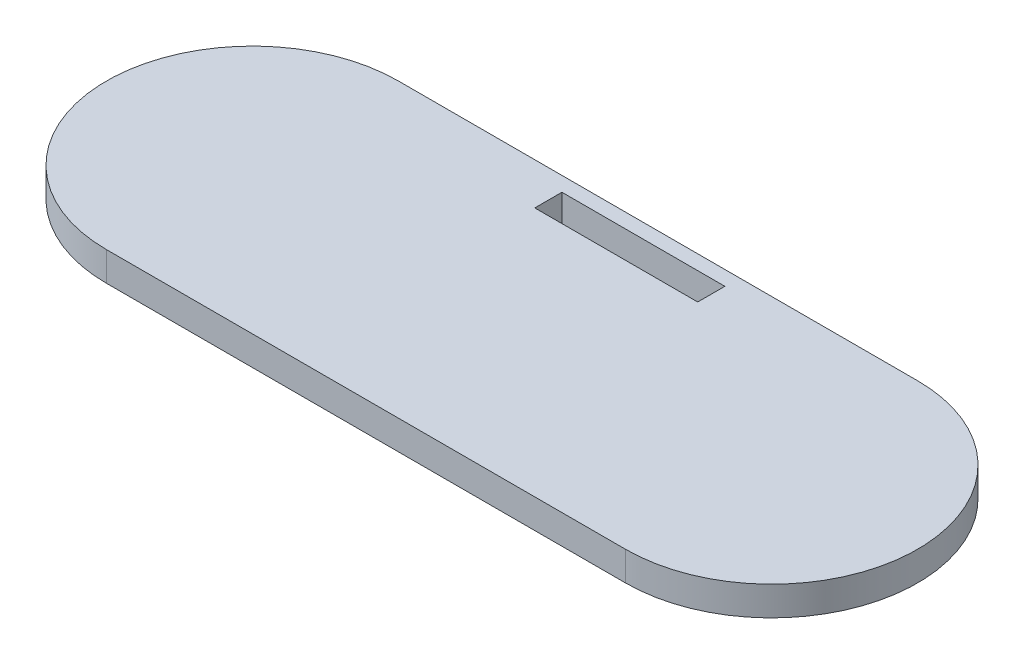
ISO-10303-21;
HEADER;
FILE_DESCRIPTION(('STEP AP214'),'2;1');
FILE_NAME('part.step','',(''),(''),'','','');
FILE_SCHEMA(('AUTOMOTIVE_DESIGN { 1 0 10303 214 1 1 1 1 }'));
ENDSEC;
DATA;
#1=APPLICATION_CONTEXT('core data for automotive mechanical design processes');
#2=APPLICATION_PROTOCOL_DEFINITION('international standard','automotive_design',2000,#1);
#3=PRODUCT_CONTEXT('',#1,'mechanical');
#4=PRODUCT('Part','Part','',(#3));
#5=PRODUCT_RELATED_PRODUCT_CATEGORY('part','',(#4));
#6=PRODUCT_DEFINITION_FORMATION('','',#4);
#7=PRODUCT_DEFINITION_CONTEXT('part definition',#1,'design');
#8=PRODUCT_DEFINITION('design','',#6,#7);
#9=PRODUCT_DEFINITION_SHAPE('','',#8);
#10=(LENGTH_UNIT() NAMED_UNIT(*) SI_UNIT(.MILLI.,.METRE.));
#11=(NAMED_UNIT(*) PLANE_ANGLE_UNIT() SI_UNIT($,.RADIAN.));
#12=(NAMED_UNIT(*) SI_UNIT($,.STERADIAN.) SOLID_ANGLE_UNIT());
#13=UNCERTAINTY_MEASURE_WITH_UNIT(LENGTH_MEASURE(1.E-05),#10,'distance_accuracy_value','');
#14=(GEOMETRIC_REPRESENTATION_CONTEXT(3) GLOBAL_UNCERTAINTY_ASSIGNED_CONTEXT((#13)) GLOBAL_UNIT_ASSIGNED_CONTEXT((#10,
#11,#12)) REPRESENTATION_CONTEXT('',''));
#15=CARTESIAN_POINT('',(0.,0.,0.));
#16=DIRECTION('',(0.,0.,1.));
#17=DIRECTION('',(1.,0.,0.));
#18=AXIS2_PLACEMENT_3D('',#15,#16,#17);
#19=CARTESIAN_POINT('',(0.,10.,0.));
#20=DIRECTION('',(0.,1.,0.));
#21=DIRECTION('',(0.,0.,1.));
#22=AXIS2_PLACEMENT_3D('',#19,#20,#21);
#23=PLANE('',#22);
#24=CARTESIAN_POINT('',(0.,10.,0.));
#25=DIRECTION('',(0.,1.,0.));
#26=DIRECTION('',(0.,0.,1.));
#27=AXIS2_PLACEMENT_3D('',#24,#25,#26);
#28=CIRCLE('',#27,50.);
#29=CARTESIAN_POINT('',(0.,10.,-50.));
#30=VERTEX_POINT('',#29);
#31=CARTESIAN_POINT('',(0.,10.,50.));
#32=VERTEX_POINT('',#31);
#33=EDGE_CURVE('E159',#30,#32,#28,.T.);
#34=ORIENTED_EDGE('',*,*,#33,.T.);
#35=DIRECTION('',(1.,0.,0.));
#36=VECTOR('',#35,1.);
#37=CARTESIAN_POINT('',(0.,10.,50.));
#38=LINE('',#37,#36);
#39=CARTESIAN_POINT('',(177.8,10.,50.));
#40=VERTEX_POINT('',#39);
#41=EDGE_CURVE('E163',#32,#40,#38,.T.);
#42=ORIENTED_EDGE('',*,*,#41,.T.);
#43=CARTESIAN_POINT('',(177.8,10.,0.));
#44=DIRECTION('',(0.,1.,0.));
#45=DIRECTION('',(0.,0.,1.));
#46=AXIS2_PLACEMENT_3D('',#43,#44,#45);
#47=CIRCLE('',#46,50.);
#48=CARTESIAN_POINT('',(177.8,10.,-50.));
#49=VERTEX_POINT('',#48);
#50=EDGE_CURVE('E167',#40,#49,#47,.T.);
#51=ORIENTED_EDGE('',*,*,#50,.T.);
#52=DIRECTION('',(-1.,0.,0.));
#53=VECTOR('',#52,1.);
#54=CARTESIAN_POINT('',(0.,10.,-50.));
#55=LINE('',#54,#53);
#56=EDGE_CURVE('E170',#49,#30,#55,.T.);
#57=ORIENTED_EDGE('',*,*,#56,.T.);
#58=EDGE_LOOP('',(#34,#42,#51,#57));
#59=FACE_BOUND('',#58,.T.);
#60=DIRECTION('',(1.,0.,0.));
#61=VECTOR('',#60,1.);
#62=CARTESIAN_POINT('',(61.,10.,-35.7));
#63=LINE('',#62,#61);
#64=CARTESIAN_POINT('',(61.,10.,-35.7));
#65=VERTEX_POINT('',#64);
#66=CARTESIAN_POINT('',(116.8,10.,-35.7));
#67=VERTEX_POINT('',#66);
#68=EDGE_CURVE('E120',#65,#67,#63,.T.);
#69=ORIENTED_EDGE('',*,*,#68,.F.);
#70=DIRECTION('',(0.,0.,1.));
#71=VECTOR('',#70,1.);
#72=CARTESIAN_POINT('',(61.,10.,-45.));
#73=LINE('',#72,#71);
#74=CARTESIAN_POINT('',(61.,10.,-45.));
#75=VERTEX_POINT('',#74);
#76=EDGE_CURVE('E111',#75,#65,#73,.T.);
#77=ORIENTED_EDGE('',*,*,#76,.F.);
#78=DIRECTION('',(-1.,0.,0.));
#79=VECTOR('',#78,1.);
#80=CARTESIAN_POINT('',(61.,10.,-45.));
#81=LINE('',#80,#79);
#82=CARTESIAN_POINT('',(116.8,10.,-45.));
#83=VERTEX_POINT('',#82);
#84=EDGE_CURVE('E137',#83,#75,#81,.T.);
#85=ORIENTED_EDGE('',*,*,#84,.F.);
#86=DIRECTION('',(0.,0.,-1.));
#87=VECTOR('',#86,1.);
#88=CARTESIAN_POINT('',(116.8,10.,-45.));
#89=LINE('',#88,#87);
#90=EDGE_CURVE('E133',#67,#83,#89,.T.);
#91=ORIENTED_EDGE('',*,*,#90,.F.);
#92=EDGE_LOOP('',(#69,#77,#85,#91));
#93=FACE_BOUND('',#92,.T.);
#94=ADVANCED_FACE('F45',(#59,#93),#23,.T.);
#95=CARTESIAN_POINT('',(0.,0.,0.));
#96=DIRECTION('',(0.,1.,0.));
#97=DIRECTION('',(0.,0.,1.));
#98=AXIS2_PLACEMENT_3D('',#95,#96,#97);
#99=PLANE('',#98);
#100=CARTESIAN_POINT('',(0.,0.,0.));
#101=DIRECTION('',(0.,1.,0.));
#102=DIRECTION('',(0.,0.,1.));
#103=AXIS2_PLACEMENT_3D('',#100,#101,#102);
#104=CIRCLE('',#103,50.);
#105=CARTESIAN_POINT('',(0.,0.,-50.));
#106=VERTEX_POINT('',#105);
#107=CARTESIAN_POINT('',(0.,0.,50.));
#108=VERTEX_POINT('',#107);
#109=EDGE_CURVE('E129',#106,#108,#104,.T.);
#110=ORIENTED_EDGE('',*,*,#109,.F.);
#111=DIRECTION('',(-1.,0.,0.));
#112=VECTOR('',#111,1.);
#113=CARTESIAN_POINT('',(0.,0.,-50.));
#114=LINE('',#113,#112);
#115=CARTESIAN_POINT('',(177.8,0.,-50.));
#116=VERTEX_POINT('',#115);
#117=EDGE_CURVE('E164',#116,#106,#114,.T.);
#118=ORIENTED_EDGE('',*,*,#117,.F.);
#119=CARTESIAN_POINT('',(177.8,0.,0.));
#120=DIRECTION('',(0.,1.,0.));
#121=DIRECTION('',(0.,0.,1.));
#122=AXIS2_PLACEMENT_3D('',#119,#120,#121);
#123=CIRCLE('',#122,50.);
#124=CARTESIAN_POINT('',(177.8,0.,50.));
#125=VERTEX_POINT('',#124);
#126=EDGE_CURVE('E180',#125,#116,#123,.T.);
#127=ORIENTED_EDGE('',*,*,#126,.F.);
#128=DIRECTION('',(1.,0.,0.));
#129=VECTOR('',#128,1.);
#130=CARTESIAN_POINT('',(0.,0.,50.));
#131=LINE('',#130,#129);
#132=EDGE_CURVE('E177',#108,#125,#131,.T.);
#133=ORIENTED_EDGE('',*,*,#132,.F.);
#134=EDGE_LOOP('',(#110,#118,#127,#133));
#135=FACE_BOUND('',#134,.T.);
#136=DIRECTION('',(0.,0.,1.));
#137=VECTOR('',#136,1.);
#138=CARTESIAN_POINT('',(61.,0.,-45.));
#139=LINE('',#138,#137);
#140=CARTESIAN_POINT('',(61.,0.,-45.));
#141=VERTEX_POINT('',#140);
#142=CARTESIAN_POINT('',(61.,0.,-35.7));
#143=VERTEX_POINT('',#142);
#144=EDGE_CURVE('E69',#141,#143,#139,.T.);
#145=ORIENTED_EDGE('',*,*,#144,.T.);
#146=DIRECTION('',(1.,0.,0.));
#147=VECTOR('',#146,1.);
#148=CARTESIAN_POINT('',(61.,0.,-35.7));
#149=LINE('',#148,#147);
#150=CARTESIAN_POINT('',(116.8,0.,-35.7));
#151=VERTEX_POINT('',#150);
#152=EDGE_CURVE('E127',#143,#151,#149,.T.);
#153=ORIENTED_EDGE('',*,*,#152,.T.);
#154=DIRECTION('',(0.,0.,-1.));
#155=VECTOR('',#154,1.);
#156=CARTESIAN_POINT('',(116.8,0.,-45.));
#157=LINE('',#156,#155);
#158=CARTESIAN_POINT('',(116.8,0.,-45.));
#159=VERTEX_POINT('',#158);
#160=EDGE_CURVE('E146',#151,#159,#157,.T.);
#161=ORIENTED_EDGE('',*,*,#160,.T.);
#162=DIRECTION('',(-1.,0.,0.));
#163=VECTOR('',#162,1.);
#164=CARTESIAN_POINT('',(61.,0.,-45.));
#165=LINE('',#164,#163);
#166=EDGE_CURVE('E121',#159,#141,#165,.T.);
#167=ORIENTED_EDGE('',*,*,#166,.T.);
#168=EDGE_LOOP('',(#145,#153,#161,#167));
#169=FACE_BOUND('',#168,.T.);
#170=ADVANCED_FACE('F203',(#135,#169),#99,.F.);
#171=CARTESIAN_POINT('',(0.,10.,0.));
#172=DIRECTION('',(0.,-1.,0.));
#173=DIRECTION('',(0.,0.,-1.));
#174=AXIS2_PLACEMENT_3D('',#171,#172,#173);
#175=CYLINDRICAL_SURFACE('',#174,50.);
#176=ORIENTED_EDGE('',*,*,#109,.T.);
#177=DIRECTION('',(0.,-1.,0.));
#178=VECTOR('',#177,1.);
#179=CARTESIAN_POINT('',(0.,10.,50.));
#180=LINE('',#179,#178);
#181=EDGE_CURVE('E11',#32,#108,#180,.T.);
#182=ORIENTED_EDGE('',*,*,#181,.F.);
#183=ORIENTED_EDGE('',*,*,#33,.F.);
#184=DIRECTION('',(0.,-1.,0.));
#185=VECTOR('',#184,1.);
#186=CARTESIAN_POINT('',(0.,10.,-50.));
#187=LINE('',#186,#185);
#188=EDGE_CURVE('E173',#30,#106,#187,.T.);
#189=ORIENTED_EDGE('',*,*,#188,.T.);
#190=EDGE_LOOP('',(#176,#182,#183,#189));
#191=FACE_BOUND('',#190,.T.);
#192=ADVANCED_FACE('F47',(#191),#175,.T.);
#193=CARTESIAN_POINT('',(0.,10.,50.));
#194=DIRECTION('',(0.,0.,-1.));
#195=DIRECTION('',(-1.,0.,0.));
#196=AXIS2_PLACEMENT_3D('',#193,#194,#195);
#197=PLANE('',#196);
#198=ORIENTED_EDGE('',*,*,#132,.T.);
#199=DIRECTION('',(0.,-1.,0.));
#200=VECTOR('',#199,1.);
#201=CARTESIAN_POINT('',(177.8,10.,50.));
#202=LINE('',#201,#200);
#203=EDGE_CURVE('E54',#40,#125,#202,.T.);
#204=ORIENTED_EDGE('',*,*,#203,.F.);
#205=ORIENTED_EDGE('',*,*,#41,.F.);
#206=ORIENTED_EDGE('',*,*,#181,.T.);
#207=EDGE_LOOP('',(#198,#204,#205,#206));
#208=FACE_BOUND('',#207,.T.);
#209=ADVANCED_FACE('F213',(#208),#197,.F.);
#210=CARTESIAN_POINT('',(177.8,10.,0.));
#211=DIRECTION('',(0.,-1.,0.));
#212=DIRECTION('',(0.,0.,-1.));
#213=AXIS2_PLACEMENT_3D('',#210,#211,#212);
#214=CYLINDRICAL_SURFACE('',#213,50.);
#215=ORIENTED_EDGE('',*,*,#126,.T.);
#216=DIRECTION('',(0.,-1.,0.));
#217=VECTOR('',#216,1.);
#218=CARTESIAN_POINT('',(177.8,10.,-50.));
#219=LINE('',#218,#217);
#220=EDGE_CURVE('E188',#49,#116,#219,.T.);
#221=ORIENTED_EDGE('',*,*,#220,.F.);
#222=ORIENTED_EDGE('',*,*,#50,.F.);
#223=ORIENTED_EDGE('',*,*,#203,.T.);
#224=EDGE_LOOP('',(#215,#221,#222,#223));
#225=FACE_BOUND('',#224,.T.);
#226=ADVANCED_FACE('F197',(#225),#214,.T.);
#227=CARTESIAN_POINT('',(0.,10.,-50.));
#228=DIRECTION('',(0.,0.,1.));
#229=DIRECTION('',(1.,0.,0.));
#230=AXIS2_PLACEMENT_3D('',#227,#228,#229);
#231=PLANE('',#230);
#232=ORIENTED_EDGE('',*,*,#117,.T.);
#233=ORIENTED_EDGE('',*,*,#188,.F.);
#234=ORIENTED_EDGE('',*,*,#56,.F.);
#235=ORIENTED_EDGE('',*,*,#220,.T.);
#236=EDGE_LOOP('',(#232,#233,#234,#235));
#237=FACE_BOUND('',#236,.T.);
#238=ADVANCED_FACE('F207',(#237),#231,.F.);
#239=CARTESIAN_POINT('',(61.,10.,-45.));
#240=DIRECTION('',(1.,0.,0.));
#241=DIRECTION('',(0.,0.,-1.));
#242=AXIS2_PLACEMENT_3D('',#239,#240,#241);
#243=PLANE('',#242);
#244=ORIENTED_EDGE('',*,*,#144,.F.);
#245=DIRECTION('',(0.,-1.,0.));
#246=VECTOR('',#245,1.);
#247=CARTESIAN_POINT('',(61.,10.,-45.));
#248=LINE('',#247,#246);
#249=EDGE_CURVE('E115',#75,#141,#248,.T.);
#250=ORIENTED_EDGE('',*,*,#249,.F.);
#251=ORIENTED_EDGE('',*,*,#76,.T.);
#252=DIRECTION('',(0.,-1.,0.));
#253=VECTOR('',#252,1.);
#254=CARTESIAN_POINT('',(61.,10.,-35.7));
#255=LINE('',#254,#253);
#256=EDGE_CURVE('E114',#65,#143,#255,.T.);
#257=ORIENTED_EDGE('',*,*,#256,.T.);
#258=EDGE_LOOP('',(#244,#250,#251,#257));
#259=FACE_BOUND('',#258,.T.);
#260=ADVANCED_FACE('F113',(#259),#243,.T.);
#261=CARTESIAN_POINT('',(61.,10.,-35.7));
#262=DIRECTION('',(0.,0.,-1.));
#263=DIRECTION('',(-1.,0.,0.));
#264=AXIS2_PLACEMENT_3D('',#261,#262,#263);
#265=PLANE('',#264);
#266=ORIENTED_EDGE('',*,*,#152,.F.);
#267=ORIENTED_EDGE('',*,*,#256,.F.);
#268=ORIENTED_EDGE('',*,*,#68,.T.);
#269=DIRECTION('',(0.,-1.,0.));
#270=VECTOR('',#269,1.);
#271=CARTESIAN_POINT('',(116.8,10.,-35.7));
#272=LINE('',#271,#270);
#273=EDGE_CURVE('E130',#67,#151,#272,.T.);
#274=ORIENTED_EDGE('',*,*,#273,.T.);
#275=EDGE_LOOP('',(#266,#267,#268,#274));
#276=FACE_BOUND('',#275,.T.);
#277=ADVANCED_FACE('F124',(#276),#265,.T.);
#278=CARTESIAN_POINT('',(116.8,10.,-45.));
#279=DIRECTION('',(-1.,0.,0.));
#280=DIRECTION('',(0.,0.,1.));
#281=AXIS2_PLACEMENT_3D('',#278,#279,#280);
#282=PLANE('',#281);
#283=ORIENTED_EDGE('',*,*,#160,.F.);
#284=ORIENTED_EDGE('',*,*,#273,.F.);
#285=ORIENTED_EDGE('',*,*,#90,.T.);
#286=DIRECTION('',(0.,-1.,0.));
#287=VECTOR('',#286,1.);
#288=CARTESIAN_POINT('',(116.8,10.,-45.));
#289=LINE('',#288,#287);
#290=EDGE_CURVE('E61',#83,#159,#289,.T.);
#291=ORIENTED_EDGE('',*,*,#290,.T.);
#292=EDGE_LOOP('',(#283,#284,#285,#291));
#293=FACE_BOUND('',#292,.T.);
#294=ADVANCED_FACE('F236',(#293),#282,.T.);
#295=CARTESIAN_POINT('',(61.,10.,-45.));
#296=DIRECTION('',(0.,0.,1.));
#297=DIRECTION('',(1.,0.,0.));
#298=AXIS2_PLACEMENT_3D('',#295,#296,#297);
#299=PLANE('',#298);
#300=ORIENTED_EDGE('',*,*,#166,.F.);
#301=ORIENTED_EDGE('',*,*,#290,.F.);
#302=ORIENTED_EDGE('',*,*,#84,.T.);
#303=ORIENTED_EDGE('',*,*,#249,.T.);
#304=EDGE_LOOP('',(#300,#301,#302,#303));
#305=FACE_BOUND('',#304,.T.);
#306=ADVANCED_FACE('F240',(#305),#299,.T.);
#307=CLOSED_SHELL('',(#94,#170,#192,#209,#226,#238,#260,#277,#294,#306));
#308=MANIFOLD_SOLID_BREP('B2',#307);
#309=ADVANCED_BREP_SHAPE_REPRESENTATION('',(#18,#308),#14);
#310=SHAPE_DEFINITION_REPRESENTATION(#9,#309);
ENDSEC;
END-ISO-10303-21;
